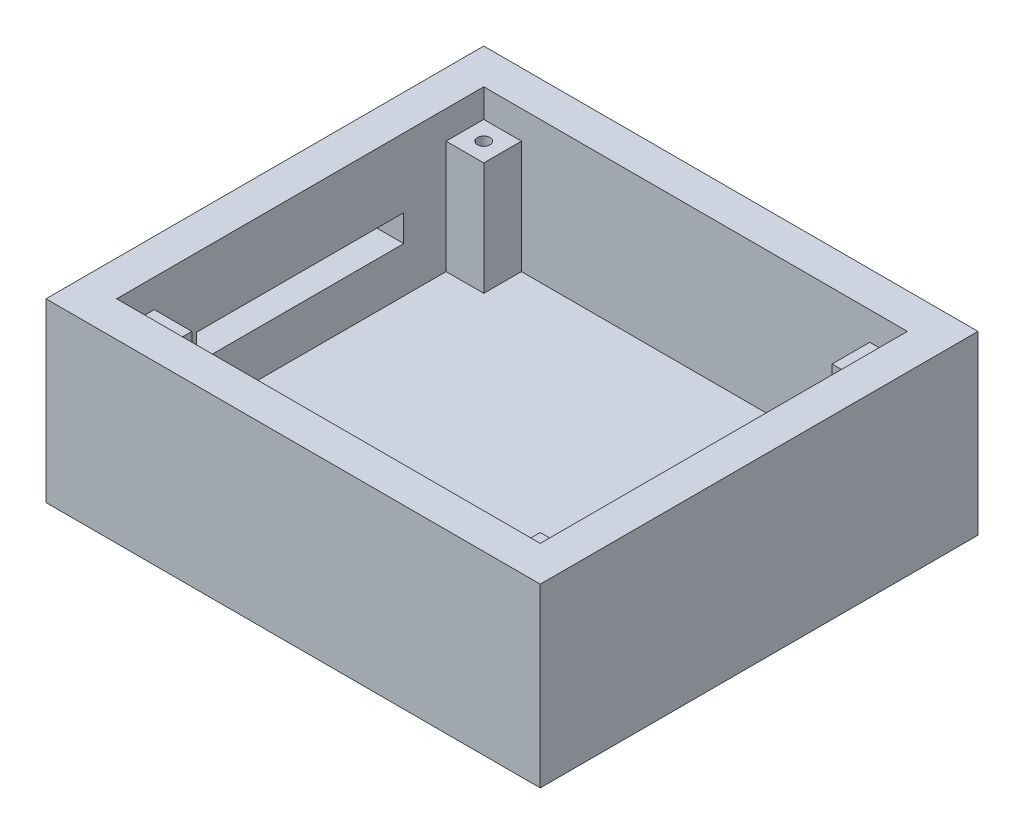
ISO-10303-21;
HEADER;
FILE_DESCRIPTION(('STEP AP214'),'2;1');
FILE_NAME('part.step','',(''),(''),'','','');
FILE_SCHEMA(('AUTOMOTIVE_DESIGN { 1 0 10303 214 1 1 1 1 }'));
ENDSEC;
DATA;
#1=APPLICATION_CONTEXT('core data for automotive mechanical design processes');
#2=APPLICATION_PROTOCOL_DEFINITION('international standard','automotive_design',2000,#1);
#3=PRODUCT_CONTEXT('',#1,'mechanical');
#4=PRODUCT('Part','Part','',(#3));
#5=PRODUCT_RELATED_PRODUCT_CATEGORY('part','',(#4));
#6=PRODUCT_DEFINITION_FORMATION('','',#4);
#7=PRODUCT_DEFINITION_CONTEXT('part definition',#1,'design');
#8=PRODUCT_DEFINITION('design','',#6,#7);
#9=PRODUCT_DEFINITION_SHAPE('','',#8);
#10=(LENGTH_UNIT() NAMED_UNIT(*) SI_UNIT(.MILLI.,.METRE.));
#11=(NAMED_UNIT(*) PLANE_ANGLE_UNIT() SI_UNIT($,.RADIAN.));
#12=(NAMED_UNIT(*) SI_UNIT($,.STERADIAN.) SOLID_ANGLE_UNIT());
#13=UNCERTAINTY_MEASURE_WITH_UNIT(LENGTH_MEASURE(1.E-05),#10,'distance_accuracy_value','');
#14=(GEOMETRIC_REPRESENTATION_CONTEXT(3) GLOBAL_UNCERTAINTY_ASSIGNED_CONTEXT((#13)) GLOBAL_UNIT_ASSIGNED_CONTEXT((#10,
#11,#12)) REPRESENTATION_CONTEXT('',''));
#15=CARTESIAN_POINT('',(0.,0.,0.));
#16=DIRECTION('',(0.,0.,1.));
#17=DIRECTION('',(1.,0.,0.));
#18=AXIS2_PLACEMENT_3D('',#15,#16,#17);
#19=CARTESIAN_POINT('',(-57.15,47.625,0.));
#20=DIRECTION('',(1.,0.,0.));
#21=DIRECTION('',(0.,0.,-1.));
#22=AXIS2_PLACEMENT_3D('',#19,#20,#21);
#23=PLANE('',#22);
#24=DIRECTION('',(0.,-1.,0.));
#25=VECTOR('',#24,1.);
#26=CARTESIAN_POINT('',(-57.15,47.625,27.94));
#27=LINE('',#26,#25);
#28=CARTESIAN_POINT('',(-57.15,29.0195,27.94));
#29=VERTEX_POINT('',#28);
#30=CARTESIAN_POINT('',(-57.15,21.7805,27.94));
#31=VERTEX_POINT('',#30);
#32=EDGE_CURVE('E230',#29,#31,#27,.T.);
#33=ORIENTED_EDGE('',*,*,#32,.F.);
#34=DIRECTION('',(0.,0.,1.));
#35=VECTOR('',#34,1.);
#36=CARTESIAN_POINT('',(-57.15,29.0195,0.));
#37=LINE('',#36,#35);
#38=CARTESIAN_POINT('',(-57.15,29.0195,-27.94));
#39=VERTEX_POINT('',#38);
#40=EDGE_CURVE('E223',#39,#29,#37,.T.);
#41=ORIENTED_EDGE('',*,*,#40,.F.);
#42=DIRECTION('',(0.,1.,0.));
#43=VECTOR('',#42,1.);
#44=CARTESIAN_POINT('',(-57.15,47.625,-27.94));
#45=LINE('',#44,#43);
#46=CARTESIAN_POINT('',(-57.15,21.7805,-27.94));
#47=VERTEX_POINT('',#46);
#48=EDGE_CURVE('E203',#47,#39,#45,.T.);
#49=ORIENTED_EDGE('',*,*,#48,.F.);
#50=DIRECTION('',(0.,0.,-1.));
#51=VECTOR('',#50,1.);
#52=CARTESIAN_POINT('',(-57.15,21.7805,0.));
#53=LINE('',#52,#51);
#54=EDGE_CURVE('E228',#31,#47,#53,.T.);
#55=ORIENTED_EDGE('',*,*,#54,.F.);
#56=EDGE_LOOP('',(#33,#41,#49,#55));
#57=FACE_BOUND('',#56,.T.);
#58=DIRECTION('',(0.,-1.,0.));
#59=VECTOR('',#58,1.);
#60=CARTESIAN_POINT('',(-57.15,47.625,49.53));
#61=LINE('',#60,#59);
#62=CARTESIAN_POINT('',(-57.15,47.625,49.53));
#63=VERTEX_POINT('',#62);
#64=CARTESIAN_POINT('',(-57.15,40.005,49.53));
#65=VERTEX_POINT('',#64);
#66=EDGE_CURVE('E370',#63,#65,#61,.T.);
#67=ORIENTED_EDGE('',*,*,#66,.T.);
#68=DIRECTION('',(0.,0.,1.));
#69=VECTOR('',#68,1.);
#70=CARTESIAN_POINT('',(-57.15,40.005,49.53));
#71=LINE('',#70,#69);
#72=CARTESIAN_POINT('',(-57.15,40.005,39.37));
#73=VERTEX_POINT('',#72);
#74=EDGE_CURVE('E236',#73,#65,#71,.T.);
#75=ORIENTED_EDGE('',*,*,#74,.F.);
#76=DIRECTION('',(0.,-1.,0.));
#77=VECTOR('',#76,1.);
#78=CARTESIAN_POINT('',(-57.15,40.005,39.37));
#79=LINE('',#78,#77);
#80=CARTESIAN_POINT('',(-57.15,9.525,39.37));
#81=VERTEX_POINT('',#80);
#82=EDGE_CURVE('E246',#73,#81,#79,.T.);
#83=ORIENTED_EDGE('',*,*,#82,.T.);
#84=DIRECTION('',(0.,0.,1.));
#85=VECTOR('',#84,1.);
#86=CARTESIAN_POINT('',(-57.15,9.525,0.));
#87=LINE('',#86,#85);
#88=CARTESIAN_POINT('',(-57.15,9.525,-39.37));
#89=VERTEX_POINT('',#88);
#90=EDGE_CURVE('E396',#89,#81,#87,.T.);
#91=ORIENTED_EDGE('',*,*,#90,.F.);
#92=DIRECTION('',(0.,-1.,0.));
#93=VECTOR('',#92,1.);
#94=CARTESIAN_POINT('',(-57.15,40.005,-39.37));
#95=LINE('',#94,#93);
#96=CARTESIAN_POINT('',(-57.15,40.005,-39.37));
#97=VERTEX_POINT('',#96);
#98=EDGE_CURVE('E334',#97,#89,#95,.T.);
#99=ORIENTED_EDGE('',*,*,#98,.F.);
#100=DIRECTION('',(0.,0.,1.));
#101=VECTOR('',#100,1.);
#102=CARTESIAN_POINT('',(-57.15,40.005,-49.53));
#103=LINE('',#102,#101);
#104=CARTESIAN_POINT('',(-57.15,40.005,-49.53));
#105=VERTEX_POINT('',#104);
#106=EDGE_CURVE('E313',#105,#97,#103,.T.);
#107=ORIENTED_EDGE('',*,*,#106,.F.);
#108=DIRECTION('',(0.,-1.,0.));
#109=VECTOR('',#108,1.);
#110=CARTESIAN_POINT('',(-57.15,47.625,-49.53));
#111=LINE('',#110,#109);
#112=CARTESIAN_POINT('',(-57.15,47.625,-49.53));
#113=VERTEX_POINT('',#112);
#114=EDGE_CURVE('E380',#113,#105,#111,.T.);
#115=ORIENTED_EDGE('',*,*,#114,.F.);
#116=DIRECTION('',(0.,0.,1.));
#117=VECTOR('',#116,1.);
#118=CARTESIAN_POINT('',(-57.15,47.625,0.));
#119=LINE('',#118,#117);
#120=EDGE_CURVE('E349',#113,#63,#119,.T.);
#121=ORIENTED_EDGE('',*,*,#120,.T.);
#122=EDGE_LOOP('',(#67,#75,#83,#91,#99,#107,#115,#121));
#123=FACE_BOUND('',#122,.T.);
#124=ADVANCED_FACE('F36',(#57,#123),#23,.T.);
#125=CARTESIAN_POINT('',(0.,47.625,49.53));
#126=DIRECTION('',(0.,0.,-1.));
#127=DIRECTION('',(-1.,0.,0.));
#128=AXIS2_PLACEMENT_3D('',#125,#126,#127);
#129=PLANE('',#128);
#130=DIRECTION('',(0.,-1.,0.));
#131=VECTOR('',#130,1.);
#132=CARTESIAN_POINT('',(-46.99,40.005,49.53));
#133=LINE('',#132,#131);
#134=CARTESIAN_POINT('',(-46.99,40.005,49.53));
#135=VERTEX_POINT('',#134);
#136=CARTESIAN_POINT('',(-46.99,9.525,49.53));
#137=VERTEX_POINT('',#136);
#138=EDGE_CURVE('E254',#135,#137,#133,.T.);
#139=ORIENTED_EDGE('',*,*,#138,.F.);
#140=DIRECTION('',(1.,0.,0.));
#141=VECTOR('',#140,1.);
#142=CARTESIAN_POINT('',(-57.15,40.005,49.53));
#143=LINE('',#142,#141);
#144=EDGE_CURVE('E238',#65,#135,#143,.T.);
#145=ORIENTED_EDGE('',*,*,#144,.F.);
#146=ORIENTED_EDGE('',*,*,#66,.F.);
#147=DIRECTION('',(1.,0.,0.));
#148=VECTOR('',#147,1.);
#149=CARTESIAN_POINT('',(0.,47.625,49.53));
#150=LINE('',#149,#148);
#151=CARTESIAN_POINT('',(57.15,47.625,49.53));
#152=VERTEX_POINT('',#151);
#153=EDGE_CURVE('E357',#63,#152,#150,.T.);
#154=ORIENTED_EDGE('',*,*,#153,.T.);
#155=DIRECTION('',(0.,-1.,0.));
#156=VECTOR('',#155,1.);
#157=CARTESIAN_POINT('',(57.15,47.625,49.53));
#158=LINE('',#157,#156);
#159=CARTESIAN_POINT('',(57.15,40.005,49.53));
#160=VERTEX_POINT('',#159);
#161=EDGE_CURVE('E373',#152,#160,#158,.T.);
#162=ORIENTED_EDGE('',*,*,#161,.T.);
#163=DIRECTION('',(1.,0.,0.));
#164=VECTOR('',#163,1.);
#165=CARTESIAN_POINT('',(57.15,40.005,49.53));
#166=LINE('',#165,#164);
#167=CARTESIAN_POINT('',(46.99,40.005,49.53));
#168=VERTEX_POINT('',#167);
#169=EDGE_CURVE('E268',#168,#160,#166,.T.);
#170=ORIENTED_EDGE('',*,*,#169,.F.);
#171=DIRECTION('',(0.,-1.,0.));
#172=VECTOR('',#171,1.);
#173=CARTESIAN_POINT('',(46.99,40.005,49.53));
#174=LINE('',#173,#172);
#175=CARTESIAN_POINT('',(46.99,9.525,49.53));
#176=VERTEX_POINT('',#175);
#177=EDGE_CURVE('E270',#168,#176,#174,.T.);
#178=ORIENTED_EDGE('',*,*,#177,.T.);
#179=DIRECTION('',(1.,0.,0.));
#180=VECTOR('',#179,1.);
#181=CARTESIAN_POINT('',(0.,9.525,49.53));
#182=LINE('',#181,#180);
#183=EDGE_CURVE('E399',#137,#176,#182,.T.);
#184=ORIENTED_EDGE('',*,*,#183,.F.);
#185=EDGE_LOOP('',(#139,#145,#146,#154,#162,#170,#178,#184));
#186=FACE_BOUND('',#185,.T.);
#187=ADVANCED_FACE('F438',(#186),#129,.T.);
#188=CARTESIAN_POINT('',(0.,47.625,-49.53));
#189=DIRECTION('',(0.,0.,-1.));
#190=DIRECTION('',(-1.,0.,0.));
#191=AXIS2_PLACEMENT_3D('',#188,#189,#190);
#192=PLANE('',#191);
#193=DIRECTION('',(-1.,0.,0.));
#194=VECTOR('',#193,1.);
#195=CARTESIAN_POINT('',(57.15,40.005,-49.53));
#196=LINE('',#195,#194);
#197=CARTESIAN_POINT('',(57.15,40.005,-49.53));
#198=VERTEX_POINT('',#197);
#199=CARTESIAN_POINT('',(46.99,40.005,-49.53));
#200=VERTEX_POINT('',#199);
#201=EDGE_CURVE('E288',#198,#200,#196,.T.);
#202=ORIENTED_EDGE('',*,*,#201,.F.);
#203=DIRECTION('',(0.,-1.,0.));
#204=VECTOR('',#203,1.);
#205=CARTESIAN_POINT('',(57.15,47.625,-49.53));
#206=LINE('',#205,#204);
#207=CARTESIAN_POINT('',(57.15,47.625,-49.53));
#208=VERTEX_POINT('',#207);
#209=EDGE_CURVE('E377',#208,#198,#206,.T.);
#210=ORIENTED_EDGE('',*,*,#209,.F.);
#211=DIRECTION('',(1.,0.,0.));
#212=VECTOR('',#211,1.);
#213=CARTESIAN_POINT('',(0.,47.625,-49.53));
#214=LINE('',#213,#212);
#215=EDGE_CURVE('E352',#113,#208,#214,.T.);
#216=ORIENTED_EDGE('',*,*,#215,.F.);
#217=ORIENTED_EDGE('',*,*,#114,.T.);
#218=DIRECTION('',(-1.,0.,0.));
#219=VECTOR('',#218,1.);
#220=CARTESIAN_POINT('',(-57.15,40.005,-49.53));
#221=LINE('',#220,#219);
#222=CARTESIAN_POINT('',(-46.99,40.005,-49.53));
#223=VERTEX_POINT('',#222);
#224=EDGE_CURVE('E322',#223,#105,#221,.T.);
#225=ORIENTED_EDGE('',*,*,#224,.F.);
#226=DIRECTION('',(0.,-1.,0.));
#227=VECTOR('',#226,1.);
#228=CARTESIAN_POINT('',(-46.99,40.005,-49.53));
#229=LINE('',#228,#227);
#230=CARTESIAN_POINT('',(-46.99,9.525,-49.53));
#231=VERTEX_POINT('',#230);
#232=EDGE_CURVE('E325',#223,#231,#229,.T.);
#233=ORIENTED_EDGE('',*,*,#232,.T.);
#234=DIRECTION('',(1.,0.,0.));
#235=VECTOR('',#234,1.);
#236=CARTESIAN_POINT('',(0.,9.525,-49.53));
#237=LINE('',#236,#235);
#238=CARTESIAN_POINT('',(46.99,9.525,-49.53));
#239=VERTEX_POINT('',#238);
#240=EDGE_CURVE('E393',#231,#239,#237,.T.);
#241=ORIENTED_EDGE('',*,*,#240,.T.);
#242=DIRECTION('',(0.,-1.,0.));
#243=VECTOR('',#242,1.);
#244=CARTESIAN_POINT('',(46.99,40.005,-49.53));
#245=LINE('',#244,#243);
#246=EDGE_CURVE('E306',#200,#239,#245,.T.);
#247=ORIENTED_EDGE('',*,*,#246,.F.);
#248=EDGE_LOOP('',(#202,#210,#216,#217,#225,#233,#241,#247));
#249=FACE_BOUND('',#248,.T.);
#250=ADVANCED_FACE('F444',(#249),#192,.F.);
#251=CARTESIAN_POINT('',(57.15,47.625,0.));
#252=DIRECTION('',(1.,0.,0.));
#253=DIRECTION('',(0.,0.,-1.));
#254=AXIS2_PLACEMENT_3D('',#251,#252,#253);
#255=PLANE('',#254);
#256=DIRECTION('',(0.,-1.,0.));
#257=VECTOR('',#256,1.);
#258=CARTESIAN_POINT('',(57.15,40.005,39.37));
#259=LINE('',#258,#257);
#260=CARTESIAN_POINT('',(57.15,40.005,39.37));
#261=VERTEX_POINT('',#260);
#262=CARTESIAN_POINT('',(57.15,9.525,39.37));
#263=VERTEX_POINT('',#262);
#264=EDGE_CURVE('E279',#261,#263,#259,.T.);
#265=ORIENTED_EDGE('',*,*,#264,.F.);
#266=DIRECTION('',(0.,0.,-1.));
#267=VECTOR('',#266,1.);
#268=CARTESIAN_POINT('',(57.15,40.005,49.53));
#269=LINE('',#268,#267);
#270=EDGE_CURVE('E260',#160,#261,#269,.T.);
#271=ORIENTED_EDGE('',*,*,#270,.F.);
#272=ORIENTED_EDGE('',*,*,#161,.F.);
#273=DIRECTION('',(0.,0.,1.));
#274=VECTOR('',#273,1.);
#275=CARTESIAN_POINT('',(57.15,47.625,0.));
#276=LINE('',#275,#274);
#277=EDGE_CURVE('E355',#208,#152,#276,.T.);
#278=ORIENTED_EDGE('',*,*,#277,.F.);
#279=ORIENTED_EDGE('',*,*,#209,.T.);
#280=DIRECTION('',(0.,0.,-1.));
#281=VECTOR('',#280,1.);
#282=CARTESIAN_POINT('',(57.15,40.005,-49.53));
#283=LINE('',#282,#281);
#284=CARTESIAN_POINT('',(57.15,40.005,-39.37));
#285=VERTEX_POINT('',#284);
#286=EDGE_CURVE('E285',#285,#198,#283,.T.);
#287=ORIENTED_EDGE('',*,*,#286,.F.);
#288=DIRECTION('',(0.,-1.,0.));
#289=VECTOR('',#288,1.);
#290=CARTESIAN_POINT('',(57.15,40.005,-39.37));
#291=LINE('',#290,#289);
#292=CARTESIAN_POINT('',(57.15,9.525,-39.37));
#293=VERTEX_POINT('',#292);
#294=EDGE_CURVE('E297',#285,#293,#291,.T.);
#295=ORIENTED_EDGE('',*,*,#294,.T.);
#296=DIRECTION('',(0.,0.,1.));
#297=VECTOR('',#296,1.);
#298=CARTESIAN_POINT('',(57.15,9.525,0.));
#299=LINE('',#298,#297);
#300=EDGE_CURVE('E383',#293,#263,#299,.T.);
#301=ORIENTED_EDGE('',*,*,#300,.T.);
#302=EDGE_LOOP('',(#265,#271,#272,#278,#279,#287,#295,#301));
#303=FACE_BOUND('',#302,.T.);
#304=ADVANCED_FACE('F468',(#303),#255,.F.);
#305=CARTESIAN_POINT('',(0.,9.525,0.));
#306=DIRECTION('',(0.,1.,0.));
#307=DIRECTION('',(0.,0.,1.));
#308=AXIS2_PLACEMENT_3D('',#305,#306,#307);
#309=PLANE('',#308);
#310=DIRECTION('',(-1.,0.,0.));
#311=VECTOR('',#310,1.);
#312=CARTESIAN_POINT('',(-57.15,9.525,39.37));
#313=LINE('',#312,#311);
#314=CARTESIAN_POINT('',(-46.99,9.525,39.37));
#315=VERTEX_POINT('',#314);
#316=EDGE_CURVE('E239',#315,#81,#313,.T.);
#317=ORIENTED_EDGE('',*,*,#316,.F.);
#318=DIRECTION('',(0.,0.,-1.));
#319=VECTOR('',#318,1.);
#320=CARTESIAN_POINT('',(-46.99,9.525,49.53));
#321=LINE('',#320,#319);
#322=EDGE_CURVE('E235',#137,#315,#321,.T.);
#323=ORIENTED_EDGE('',*,*,#322,.F.);
#324=ORIENTED_EDGE('',*,*,#183,.T.);
#325=DIRECTION('',(0.,0.,1.));
#326=VECTOR('',#325,1.);
#327=CARTESIAN_POINT('',(46.99,9.525,49.53));
#328=LINE('',#327,#326);
#329=CARTESIAN_POINT('',(46.99,9.525,39.37));
#330=VERTEX_POINT('',#329);
#331=EDGE_CURVE('E264',#330,#176,#328,.T.);
#332=ORIENTED_EDGE('',*,*,#331,.F.);
#333=DIRECTION('',(-1.,0.,0.));
#334=VECTOR('',#333,1.);
#335=CARTESIAN_POINT('',(57.15,9.525,39.37));
#336=LINE('',#335,#334);
#337=EDGE_CURVE('E259',#263,#330,#336,.T.);
#338=ORIENTED_EDGE('',*,*,#337,.F.);
#339=ORIENTED_EDGE('',*,*,#300,.F.);
#340=DIRECTION('',(1.,0.,0.));
#341=VECTOR('',#340,1.);
#342=CARTESIAN_POINT('',(57.15,9.525,-39.37));
#343=LINE('',#342,#341);
#344=CARTESIAN_POINT('',(46.99,9.525,-39.37));
#345=VERTEX_POINT('',#344);
#346=EDGE_CURVE('E289',#345,#293,#343,.T.);
#347=ORIENTED_EDGE('',*,*,#346,.F.);
#348=DIRECTION('',(0.,0.,1.));
#349=VECTOR('',#348,1.);
#350=CARTESIAN_POINT('',(46.99,9.525,-49.53));
#351=LINE('',#350,#349);
#352=EDGE_CURVE('E284',#239,#345,#351,.T.);
#353=ORIENTED_EDGE('',*,*,#352,.F.);
#354=ORIENTED_EDGE('',*,*,#240,.F.);
#355=DIRECTION('',(0.,0.,-1.));
#356=VECTOR('',#355,1.);
#357=CARTESIAN_POINT('',(-46.99,9.525,-49.53));
#358=LINE('',#357,#356);
#359=CARTESIAN_POINT('',(-46.99,9.525,-39.37));
#360=VERTEX_POINT('',#359);
#361=EDGE_CURVE('E317',#360,#231,#358,.T.);
#362=ORIENTED_EDGE('',*,*,#361,.F.);
#363=DIRECTION('',(1.,0.,0.));
#364=VECTOR('',#363,1.);
#365=CARTESIAN_POINT('',(-57.15,9.525,-39.37));
#366=LINE('',#365,#364);
#367=EDGE_CURVE('E312',#89,#360,#366,.T.);
#368=ORIENTED_EDGE('',*,*,#367,.F.);
#369=ORIENTED_EDGE('',*,*,#90,.T.);
#370=EDGE_LOOP('',(#317,#323,#324,#332,#338,#339,#347,#353,#354,#362,#368,#369));
#371=FACE_BOUND('',#370,.T.);
#372=ADVANCED_FACE('F426',(#371),#309,.T.);
#373=CARTESIAN_POINT('',(0.,47.625,59.055));
#374=DIRECTION('',(0.,0.,-1.));
#375=DIRECTION('',(-1.,0.,0.));
#376=AXIS2_PLACEMENT_3D('',#373,#374,#375);
#377=PLANE('',#376);
#378=DIRECTION('',(1.,0.,0.));
#379=VECTOR('',#378,1.);
#380=CARTESIAN_POINT('',(0.,0.,59.055));
#381=LINE('',#380,#379);
#382=CARTESIAN_POINT('',(-66.675,0.,59.055));
#383=VERTEX_POINT('',#382);
#384=CARTESIAN_POINT('',(66.675,0.,59.055));
#385=VERTEX_POINT('',#384);
#386=EDGE_CURVE('E337',#383,#385,#381,.T.);
#387=ORIENTED_EDGE('',*,*,#386,.T.);
#388=DIRECTION('',(0.,-1.,0.));
#389=VECTOR('',#388,1.);
#390=CARTESIAN_POINT('',(66.675,47.625,59.055));
#391=LINE('',#390,#389);
#392=CARTESIAN_POINT('',(66.675,47.625,59.055));
#393=VERTEX_POINT('',#392);
#394=EDGE_CURVE('E374',#393,#385,#391,.T.);
#395=ORIENTED_EDGE('',*,*,#394,.F.);
#396=DIRECTION('',(1.,0.,0.));
#397=VECTOR('',#396,1.);
#398=CARTESIAN_POINT('',(0.,47.625,59.055));
#399=LINE('',#398,#397);
#400=CARTESIAN_POINT('',(-66.675,47.625,59.055));
#401=VERTEX_POINT('',#400);
#402=EDGE_CURVE('E338',#401,#393,#399,.T.);
#403=ORIENTED_EDGE('',*,*,#402,.F.);
#404=DIRECTION('',(0.,-1.,0.));
#405=VECTOR('',#404,1.);
#406=CARTESIAN_POINT('',(-66.675,47.625,59.055));
#407=LINE('',#406,#405);
#408=EDGE_CURVE('E360',#401,#383,#407,.T.);
#409=ORIENTED_EDGE('',*,*,#408,.T.);
#410=EDGE_LOOP('',(#387,#395,#403,#409));
#411=FACE_BOUND('',#410,.T.);
#412=ADVANCED_FACE('F461',(#411),#377,.F.);
#413=CARTESIAN_POINT('',(66.675,47.625,0.));
#414=DIRECTION('',(1.,0.,0.));
#415=DIRECTION('',(0.,0.,-1.));
#416=AXIS2_PLACEMENT_3D('',#413,#414,#415);
#417=PLANE('',#416);
#418=DIRECTION('',(0.,0.,1.));
#419=VECTOR('',#418,1.);
#420=CARTESIAN_POINT('',(66.675,0.,0.));
#421=LINE('',#420,#419);
#422=CARTESIAN_POINT('',(66.675,0.,-59.055));
#423=VERTEX_POINT('',#422);
#424=EDGE_CURVE('E363',#423,#385,#421,.T.);
#425=ORIENTED_EDGE('',*,*,#424,.F.);
#426=DIRECTION('',(0.,-1.,0.));
#427=VECTOR('',#426,1.);
#428=CARTESIAN_POINT('',(66.675,47.625,-59.055));
#429=LINE('',#428,#427);
#430=CARTESIAN_POINT('',(66.675,47.625,-59.055));
#431=VERTEX_POINT('',#430);
#432=EDGE_CURVE('E388',#431,#423,#429,.T.);
#433=ORIENTED_EDGE('',*,*,#432,.F.);
#434=DIRECTION('',(0.,0.,1.));
#435=VECTOR('',#434,1.);
#436=CARTESIAN_POINT('',(66.675,47.625,0.));
#437=LINE('',#436,#435);
#438=EDGE_CURVE('E340',#431,#393,#437,.T.);
#439=ORIENTED_EDGE('',*,*,#438,.T.);
#440=ORIENTED_EDGE('',*,*,#394,.T.);
#441=EDGE_LOOP('',(#425,#433,#439,#440));
#442=FACE_BOUND('',#441,.T.);
#443=ADVANCED_FACE('F458',(#442),#417,.T.);
#444=CARTESIAN_POINT('',(0.,47.625,-59.055));
#445=DIRECTION('',(0.,0.,-1.));
#446=DIRECTION('',(-1.,0.,0.));
#447=AXIS2_PLACEMENT_3D('',#444,#445,#446);
#448=PLANE('',#447);
#449=DIRECTION('',(1.,0.,0.));
#450=VECTOR('',#449,1.);
#451=CARTESIAN_POINT('',(0.,0.,-59.055));
#452=LINE('',#451,#450);
#453=CARTESIAN_POINT('',(-66.675,0.,-59.055));
#454=VERTEX_POINT('',#453);
#455=EDGE_CURVE('E366',#454,#423,#452,.T.);
#456=ORIENTED_EDGE('',*,*,#455,.F.);
#457=DIRECTION('',(0.,-1.,0.));
#458=VECTOR('',#457,1.);
#459=CARTESIAN_POINT('',(-66.675,47.625,-59.055));
#460=LINE('',#459,#458);
#461=CARTESIAN_POINT('',(-66.675,47.625,-59.055));
#462=VERTEX_POINT('',#461);
#463=EDGE_CURVE('E386',#462,#454,#460,.T.);
#464=ORIENTED_EDGE('',*,*,#463,.F.);
#465=DIRECTION('',(1.,0.,0.));
#466=VECTOR('',#465,1.);
#467=CARTESIAN_POINT('',(0.,47.625,-59.055));
#468=LINE('',#467,#466);
#469=EDGE_CURVE('E344',#462,#431,#468,.T.);
#470=ORIENTED_EDGE('',*,*,#469,.T.);
#471=ORIENTED_EDGE('',*,*,#432,.T.);
#472=EDGE_LOOP('',(#456,#464,#470,#471));
#473=FACE_BOUND('',#472,.T.);
#474=ADVANCED_FACE('F455',(#473),#448,.T.);
#475=CARTESIAN_POINT('',(-66.675,47.625,0.));
#476=DIRECTION('',(1.,0.,0.));
#477=DIRECTION('',(0.,0.,-1.));
#478=AXIS2_PLACEMENT_3D('',#475,#476,#477);
#479=PLANE('',#478);
#480=DIRECTION('',(0.,0.,-1.));
#481=VECTOR('',#480,1.);
#482=CARTESIAN_POINT('',(-66.675,29.0195,-27.94));
#483=LINE('',#482,#481);
#484=CARTESIAN_POINT('',(-66.675,29.0195,27.94));
#485=VERTEX_POINT('',#484);
#486=CARTESIAN_POINT('',(-66.675,29.0195,-27.94));
#487=VERTEX_POINT('',#486);
#488=EDGE_CURVE('E209',#485,#487,#483,.T.);
#489=ORIENTED_EDGE('',*,*,#488,.F.);
#490=DIRECTION('',(0.,1.,0.));
#491=VECTOR('',#490,1.);
#492=CARTESIAN_POINT('',(-66.675,29.0195,27.94));
#493=LINE('',#492,#491);
#494=CARTESIAN_POINT('',(-66.675,21.7805,27.94));
#495=VERTEX_POINT('',#494);
#496=EDGE_CURVE('E59',#495,#485,#493,.T.);
#497=ORIENTED_EDGE('',*,*,#496,.F.);
#498=DIRECTION('',(0.,0.,1.));
#499=VECTOR('',#498,1.);
#500=CARTESIAN_POINT('',(-66.675,21.7805,-27.94));
#501=LINE('',#500,#499);
#502=CARTESIAN_POINT('',(-66.675,21.7805,-27.94));
#503=VERTEX_POINT('',#502);
#504=EDGE_CURVE('E216',#503,#495,#501,.T.);
#505=ORIENTED_EDGE('',*,*,#504,.F.);
#506=DIRECTION('',(0.,-1.,0.));
#507=VECTOR('',#506,1.);
#508=CARTESIAN_POINT('',(-66.675,29.0195,-27.94));
#509=LINE('',#508,#507);
#510=EDGE_CURVE('E200',#487,#503,#509,.T.);
#511=ORIENTED_EDGE('',*,*,#510,.F.);
#512=EDGE_LOOP('',(#489,#497,#505,#511));
#513=FACE_BOUND('',#512,.T.);
#514=DIRECTION('',(0.,0.,1.));
#515=VECTOR('',#514,1.);
#516=CARTESIAN_POINT('',(-66.675,0.,0.));
#517=LINE('',#516,#515);
#518=EDGE_CURVE('E341',#454,#383,#517,.T.);
#519=ORIENTED_EDGE('',*,*,#518,.T.);
#520=ORIENTED_EDGE('',*,*,#408,.F.);
#521=DIRECTION('',(0.,0.,1.));
#522=VECTOR('',#521,1.);
#523=CARTESIAN_POINT('',(-66.675,47.625,0.));
#524=LINE('',#523,#522);
#525=EDGE_CURVE('E347',#462,#401,#524,.T.);
#526=ORIENTED_EDGE('',*,*,#525,.F.);
#527=ORIENTED_EDGE('',*,*,#463,.T.);
#528=EDGE_LOOP('',(#519,#520,#526,#527));
#529=FACE_BOUND('',#528,.T.);
#530=ADVANCED_FACE('F213',(#513,#529),#479,.F.);
#531=CARTESIAN_POINT('',(0.,47.625,0.));
#532=DIRECTION('',(0.,1.,0.));
#533=DIRECTION('',(0.,0.,1.));
#534=AXIS2_PLACEMENT_3D('',#531,#532,#533);
#535=PLANE('',#534);
#536=ORIENTED_EDGE('',*,*,#402,.T.);
#537=ORIENTED_EDGE('',*,*,#438,.F.);
#538=ORIENTED_EDGE('',*,*,#469,.F.);
#539=ORIENTED_EDGE('',*,*,#525,.T.);
#540=EDGE_LOOP('',(#536,#537,#538,#539));
#541=FACE_BOUND('',#540,.T.);
#542=ORIENTED_EDGE('',*,*,#120,.F.);
#543=ORIENTED_EDGE('',*,*,#215,.T.);
#544=ORIENTED_EDGE('',*,*,#277,.T.);
#545=ORIENTED_EDGE('',*,*,#153,.F.);
#546=EDGE_LOOP('',(#542,#543,#544,#545));
#547=FACE_BOUND('',#546,.T.);
#548=ADVANCED_FACE('F454',(#541,#547),#535,.T.);
#549=CARTESIAN_POINT('',(0.,0.,0.));
#550=DIRECTION('',(0.,1.,0.));
#551=DIRECTION('',(0.,0.,1.));
#552=AXIS2_PLACEMENT_3D('',#549,#550,#551);
#553=PLANE('',#552);
#554=ORIENTED_EDGE('',*,*,#386,.F.);
#555=ORIENTED_EDGE('',*,*,#518,.F.);
#556=ORIENTED_EDGE('',*,*,#455,.T.);
#557=ORIENTED_EDGE('',*,*,#424,.T.);
#558=EDGE_LOOP('',(#554,#555,#556,#557));
#559=FACE_BOUND('',#558,.T.);
#560=ADVANCED_FACE('F38',(#559),#553,.F.);
#561=CARTESIAN_POINT('',(0.,40.005,0.));
#562=DIRECTION('',(0.,1.,0.));
#563=DIRECTION('',(0.,0.,1.));
#564=AXIS2_PLACEMENT_3D('',#561,#562,#563);
#565=PLANE('',#564);
#566=ORIENTED_EDGE('',*,*,#106,.T.);
#567=DIRECTION('',(1.,0.,0.));
#568=VECTOR('',#567,1.);
#569=CARTESIAN_POINT('',(-57.15,40.005,-39.37));
#570=LINE('',#569,#568);
#571=CARTESIAN_POINT('',(-46.99,40.005,-39.37));
#572=VERTEX_POINT('',#571);
#573=EDGE_CURVE('E316',#97,#572,#570,.T.);
#574=ORIENTED_EDGE('',*,*,#573,.T.);
#575=DIRECTION('',(0.,0.,-1.));
#576=VECTOR('',#575,1.);
#577=CARTESIAN_POINT('',(-46.99,40.005,-49.53));
#578=LINE('',#577,#576);
#579=EDGE_CURVE('E319',#572,#223,#578,.T.);
#580=ORIENTED_EDGE('',*,*,#579,.T.);
#581=ORIENTED_EDGE('',*,*,#224,.T.);
#582=EDGE_LOOP('',(#566,#574,#580,#581));
#583=FACE_BOUND('',#582,.T.);
#584=CARTESIAN_POINT('',(-52.07,40.005,-44.45));
#585=DIRECTION('',(0.,1.,0.));
#586=DIRECTION('',(0.,0.,1.));
#587=AXIS2_PLACEMENT_3D('',#584,#585,#586);
#588=CIRCLE('',#587,1.70180000000001);
#589=CARTESIAN_POINT('',(-52.07,40.005,-42.7482));
#590=VERTEX_POINT('',#589);
#591=EDGE_CURVE('E309',#590,#590,#588,.T.);
#592=ORIENTED_EDGE('',*,*,#591,.F.);
#593=EDGE_LOOP('',(#592));
#594=FACE_BOUND('',#593,.T.);
#595=ADVANCED_FACE('F537',(#583,#594),#565,.T.);
#596=CARTESIAN_POINT('',(-57.15,40.005,-39.37));
#597=DIRECTION('',(0.,0.,-1.));
#598=DIRECTION('',(-1.,0.,0.));
#599=AXIS2_PLACEMENT_3D('',#596,#597,#598);
#600=PLANE('',#599);
#601=ORIENTED_EDGE('',*,*,#367,.T.);
#602=DIRECTION('',(0.,-1.,0.));
#603=VECTOR('',#602,1.);
#604=CARTESIAN_POINT('',(-46.99,40.005,-39.37));
#605=LINE('',#604,#603);
#606=EDGE_CURVE('E331',#572,#360,#605,.T.);
#607=ORIENTED_EDGE('',*,*,#606,.F.);
#608=ORIENTED_EDGE('',*,*,#573,.F.);
#609=ORIENTED_EDGE('',*,*,#98,.T.);
#610=EDGE_LOOP('',(#601,#607,#608,#609));
#611=FACE_BOUND('',#610,.T.);
#612=ADVANCED_FACE('F530',(#611),#600,.F.);
#613=CARTESIAN_POINT('',(-46.99,40.005,-49.53));
#614=DIRECTION('',(-1.,0.,0.));
#615=DIRECTION('',(0.,0.,1.));
#616=AXIS2_PLACEMENT_3D('',#613,#614,#615);
#617=PLANE('',#616);
#618=ORIENTED_EDGE('',*,*,#361,.T.);
#619=ORIENTED_EDGE('',*,*,#232,.F.);
#620=ORIENTED_EDGE('',*,*,#579,.F.);
#621=ORIENTED_EDGE('',*,*,#606,.T.);
#622=EDGE_LOOP('',(#618,#619,#620,#621));
#623=FACE_BOUND('',#622,.T.);
#624=ADVANCED_FACE('F534',(#623),#617,.F.);
#625=CARTESIAN_POINT('',(-52.07,40.005,-44.45));
#626=DIRECTION('',(0.,-1.,0.));
#627=DIRECTION('',(0.,0.,-1.));
#628=AXIS2_PLACEMENT_3D('',#625,#626,#627);
#629=CYLINDRICAL_SURFACE('',#628,1.70180000000001);
#630=ORIENTED_EDGE('',*,*,#591,.T.);
#631=EDGE_LOOP('',(#630));
#632=FACE_BOUND('',#631,.T.);
#633=CARTESIAN_POINT('',(-52.07,9.525,-44.45));
#634=DIRECTION('',(0.,1.,0.));
#635=DIRECTION('',(0.,0.,1.));
#636=AXIS2_PLACEMENT_3D('',#633,#634,#635);
#637=CIRCLE('',#636,1.70180000000001);
#638=CARTESIAN_POINT('',(-52.07,9.525,-42.7482));
#639=VERTEX_POINT('',#638);
#640=EDGE_CURVE('E401',#639,#639,#637,.F.);
#641=ORIENTED_EDGE('',*,*,#640,.T.);
#642=EDGE_LOOP('',(#641));
#643=FACE_BOUND('',#642,.T.);
#644=ADVANCED_FACE('F550',(#632,#643),#629,.F.);
#645=ORIENTED_EDGE('',*,*,#640,.F.);
#646=EDGE_LOOP('',(#645));
#647=FACE_BOUND('',#646,.T.);
#648=ADVANCED_FACE('F432',(#647),#309,.T.);
#649=CARTESIAN_POINT('',(0.,40.005,0.));
#650=DIRECTION('',(0.,-1.,0.));
#651=DIRECTION('',(0.,0.,-1.));
#652=AXIS2_PLACEMENT_3D('',#649,#650,#651);
#653=PLANE('',#652);
#654=ORIENTED_EDGE('',*,*,#286,.T.);
#655=ORIENTED_EDGE('',*,*,#201,.T.);
#656=DIRECTION('',(0.,0.,1.));
#657=VECTOR('',#656,1.);
#658=CARTESIAN_POINT('',(46.99,40.005,-49.53));
#659=LINE('',#658,#657);
#660=CARTESIAN_POINT('',(46.99,40.005,-39.37));
#661=VERTEX_POINT('',#660);
#662=EDGE_CURVE('E292',#200,#661,#659,.T.);
#663=ORIENTED_EDGE('',*,*,#662,.T.);
#664=DIRECTION('',(1.,0.,0.));
#665=VECTOR('',#664,1.);
#666=CARTESIAN_POINT('',(57.15,40.005,-39.37));
#667=LINE('',#666,#665);
#668=EDGE_CURVE('E294',#661,#285,#667,.T.);
#669=ORIENTED_EDGE('',*,*,#668,.T.);
#670=EDGE_LOOP('',(#654,#655,#663,#669));
#671=FACE_BOUND('',#670,.T.);
#672=CARTESIAN_POINT('',(52.07,40.005,-44.45));
#673=DIRECTION('',(0.,1.,0.));
#674=DIRECTION('',(0.,0.,1.));
#675=AXIS2_PLACEMENT_3D('',#672,#673,#674);
#676=CIRCLE('',#675,1.70180000000001);
#677=CARTESIAN_POINT('',(52.07,40.005,-42.7482));
#678=VERTEX_POINT('',#677);
#679=EDGE_CURVE('E281',#678,#678,#676,.T.);
#680=ORIENTED_EDGE('',*,*,#679,.F.);
#681=EDGE_LOOP('',(#680));
#682=FACE_BOUND('',#681,.T.);
#683=ADVANCED_FACE('F495',(#671,#682),#653,.F.);
#684=CARTESIAN_POINT('',(46.99,40.005,-49.53));
#685=DIRECTION('',(1.,0.,0.));
#686=DIRECTION('',(0.,0.,-1.));
#687=AXIS2_PLACEMENT_3D('',#684,#685,#686);
#688=PLANE('',#687);
#689=ORIENTED_EDGE('',*,*,#352,.T.);
#690=DIRECTION('',(0.,-1.,0.));
#691=VECTOR('',#690,1.);
#692=CARTESIAN_POINT('',(46.99,40.005,-39.37));
#693=LINE('',#692,#691);
#694=EDGE_CURVE('E303',#661,#345,#693,.T.);
#695=ORIENTED_EDGE('',*,*,#694,.F.);
#696=ORIENTED_EDGE('',*,*,#662,.F.);
#697=ORIENTED_EDGE('',*,*,#246,.T.);
#698=EDGE_LOOP('',(#689,#695,#696,#697));
#699=FACE_BOUND('',#698,.T.);
#700=ADVANCED_FACE('F540',(#699),#688,.F.);
#701=CARTESIAN_POINT('',(57.15,40.005,-39.37));
#702=DIRECTION('',(0.,0.,-1.));
#703=DIRECTION('',(-1.,0.,0.));
#704=AXIS2_PLACEMENT_3D('',#701,#702,#703);
#705=PLANE('',#704);
#706=ORIENTED_EDGE('',*,*,#346,.T.);
#707=ORIENTED_EDGE('',*,*,#294,.F.);
#708=ORIENTED_EDGE('',*,*,#668,.F.);
#709=ORIENTED_EDGE('',*,*,#694,.T.);
#710=EDGE_LOOP('',(#706,#707,#708,#709));
#711=FACE_BOUND('',#710,.T.);
#712=ADVANCED_FACE('F502',(#711),#705,.F.);
#713=CARTESIAN_POINT('',(52.07,40.005,-44.45));
#714=DIRECTION('',(0.,-1.,0.));
#715=DIRECTION('',(0.,0.,-1.));
#716=AXIS2_PLACEMENT_3D('',#713,#714,#715);
#717=CYLINDRICAL_SURFACE('',#716,1.70180000000001);
#718=ORIENTED_EDGE('',*,*,#679,.T.);
#719=EDGE_LOOP('',(#718));
#720=FACE_BOUND('',#719,.T.);
#721=CARTESIAN_POINT('',(52.07,9.525,-44.45));
#722=DIRECTION('',(0.,1.,0.));
#723=DIRECTION('',(0.,0.,1.));
#724=AXIS2_PLACEMENT_3D('',#721,#722,#723);
#725=CIRCLE('',#724,1.70180000000001);
#726=CARTESIAN_POINT('',(52.07,9.525,-42.7482));
#727=VERTEX_POINT('',#726);
#728=EDGE_CURVE('E404',#727,#727,#725,.F.);
#729=ORIENTED_EDGE('',*,*,#728,.T.);
#730=EDGE_LOOP('',(#729));
#731=FACE_BOUND('',#730,.T.);
#732=ADVANCED_FACE('F430',(#720,#731),#717,.F.);
#733=ORIENTED_EDGE('',*,*,#728,.F.);
#734=EDGE_LOOP('',(#733));
#735=FACE_BOUND('',#734,.T.);
#736=ADVANCED_FACE('F414',(#735),#309,.T.);
#737=CARTESIAN_POINT('',(0.,40.005,0.));
#738=DIRECTION('',(0.,1.,0.));
#739=DIRECTION('',(0.,0.,1.));
#740=AXIS2_PLACEMENT_3D('',#737,#738,#739);
#741=PLANE('',#740);
#742=ORIENTED_EDGE('',*,*,#270,.T.);
#743=DIRECTION('',(-1.,0.,0.));
#744=VECTOR('',#743,1.);
#745=CARTESIAN_POINT('',(57.15,40.005,39.37));
#746=LINE('',#745,#744);
#747=CARTESIAN_POINT('',(46.99,40.005,39.37));
#748=VERTEX_POINT('',#747);
#749=EDGE_CURVE('E263',#261,#748,#746,.T.);
#750=ORIENTED_EDGE('',*,*,#749,.T.);
#751=DIRECTION('',(0.,0.,1.));
#752=VECTOR('',#751,1.);
#753=CARTESIAN_POINT('',(46.99,40.005,49.53));
#754=LINE('',#753,#752);
#755=EDGE_CURVE('E266',#748,#168,#754,.T.);
#756=ORIENTED_EDGE('',*,*,#755,.T.);
#757=ORIENTED_EDGE('',*,*,#169,.T.);
#758=EDGE_LOOP('',(#742,#750,#756,#757));
#759=FACE_BOUND('',#758,.T.);
#760=CARTESIAN_POINT('',(52.07,40.005,44.45));
#761=DIRECTION('',(0.,1.,0.));
#762=DIRECTION('',(0.,0.,1.));
#763=AXIS2_PLACEMENT_3D('',#760,#761,#762);
#764=CIRCLE('',#763,1.70180000000001);
#765=CARTESIAN_POINT('',(52.07,40.005,46.1518));
#766=VERTEX_POINT('',#765);
#767=EDGE_CURVE('E256',#766,#766,#764,.T.);
#768=ORIENTED_EDGE('',*,*,#767,.F.);
#769=EDGE_LOOP('',(#768));
#770=FACE_BOUND('',#769,.T.);
#771=ADVANCED_FACE('F429',(#759,#770),#741,.T.);
#772=CARTESIAN_POINT('',(57.15,40.005,39.37));
#773=DIRECTION('',(0.,0.,1.));
#774=DIRECTION('',(1.,0.,0.));
#775=AXIS2_PLACEMENT_3D('',#772,#773,#774);
#776=PLANE('',#775);
#777=ORIENTED_EDGE('',*,*,#337,.T.);
#778=DIRECTION('',(0.,-1.,0.));
#779=VECTOR('',#778,1.);
#780=CARTESIAN_POINT('',(46.99,40.005,39.37));
#781=LINE('',#780,#779);
#782=EDGE_CURVE('E276',#748,#330,#781,.T.);
#783=ORIENTED_EDGE('',*,*,#782,.F.);
#784=ORIENTED_EDGE('',*,*,#749,.F.);
#785=ORIENTED_EDGE('',*,*,#264,.T.);
#786=EDGE_LOOP('',(#777,#783,#784,#785));
#787=FACE_BOUND('',#786,.T.);
#788=ADVANCED_FACE('F509',(#787),#776,.F.);
#789=CARTESIAN_POINT('',(46.99,40.005,49.53));
#790=DIRECTION('',(1.,0.,0.));
#791=DIRECTION('',(0.,0.,-1.));
#792=AXIS2_PLACEMENT_3D('',#789,#790,#791);
#793=PLANE('',#792);
#794=ORIENTED_EDGE('',*,*,#331,.T.);
#795=ORIENTED_EDGE('',*,*,#177,.F.);
#796=ORIENTED_EDGE('',*,*,#755,.F.);
#797=ORIENTED_EDGE('',*,*,#782,.T.);
#798=EDGE_LOOP('',(#794,#795,#796,#797));
#799=FACE_BOUND('',#798,.T.);
#800=ADVANCED_FACE('F423',(#799),#793,.F.);
#801=CARTESIAN_POINT('',(52.07,40.005,44.45));
#802=DIRECTION('',(0.,-1.,0.));
#803=DIRECTION('',(0.,0.,-1.));
#804=AXIS2_PLACEMENT_3D('',#801,#802,#803);
#805=CYLINDRICAL_SURFACE('',#804,1.70180000000001);
#806=ORIENTED_EDGE('',*,*,#767,.T.);
#807=EDGE_LOOP('',(#806));
#808=FACE_BOUND('',#807,.T.);
#809=CARTESIAN_POINT('',(52.07,9.525,44.45));
#810=DIRECTION('',(0.,1.,0.));
#811=DIRECTION('',(0.,0.,1.));
#812=AXIS2_PLACEMENT_3D('',#809,#810,#811);
#813=CIRCLE('',#812,1.70180000000001);
#814=CARTESIAN_POINT('',(52.07,9.525,46.1518));
#815=VERTEX_POINT('',#814);
#816=EDGE_CURVE('E44',#815,#815,#813,.F.);
#817=ORIENTED_EDGE('',*,*,#816,.T.);
#818=EDGE_LOOP('',(#817));
#819=FACE_BOUND('',#818,.T.);
#820=ADVANCED_FACE('F409',(#808,#819),#805,.F.);
#821=ORIENTED_EDGE('',*,*,#816,.F.);
#822=EDGE_LOOP('',(#821));
#823=FACE_BOUND('',#822,.T.);
#824=ADVANCED_FACE('F411',(#823),#309,.T.);
#825=CARTESIAN_POINT('',(0.,40.005,0.));
#826=DIRECTION('',(0.,-1.,0.));
#827=DIRECTION('',(0.,0.,-1.));
#828=AXIS2_PLACEMENT_3D('',#825,#826,#827);
#829=PLANE('',#828);
#830=ORIENTED_EDGE('',*,*,#74,.T.);
#831=ORIENTED_EDGE('',*,*,#144,.T.);
#832=DIRECTION('',(0.,0.,-1.));
#833=VECTOR('',#832,1.);
#834=CARTESIAN_POINT('',(-46.99,40.005,49.53));
#835=LINE('',#834,#833);
#836=CARTESIAN_POINT('',(-46.99,40.005,39.37));
#837=VERTEX_POINT('',#836);
#838=EDGE_CURVE('E242',#135,#837,#835,.T.);
#839=ORIENTED_EDGE('',*,*,#838,.T.);
#840=DIRECTION('',(-1.,0.,0.));
#841=VECTOR('',#840,1.);
#842=CARTESIAN_POINT('',(-57.15,40.005,39.37));
#843=LINE('',#842,#841);
#844=EDGE_CURVE('E244',#837,#73,#843,.T.);
#845=ORIENTED_EDGE('',*,*,#844,.T.);
#846=EDGE_LOOP('',(#830,#831,#839,#845));
#847=FACE_BOUND('',#846,.T.);
#848=CARTESIAN_POINT('',(-52.07,40.005,44.45));
#849=DIRECTION('',(0.,1.,0.));
#850=DIRECTION('',(0.,0.,1.));
#851=AXIS2_PLACEMENT_3D('',#848,#849,#850);
#852=CIRCLE('',#851,1.70180000000001);
#853=CARTESIAN_POINT('',(-52.07,40.005,46.1518));
#854=VERTEX_POINT('',#853);
#855=EDGE_CURVE('E232',#854,#854,#852,.T.);
#856=ORIENTED_EDGE('',*,*,#855,.F.);
#857=EDGE_LOOP('',(#856));
#858=FACE_BOUND('',#857,.T.);
#859=ADVANCED_FACE('F413',(#847,#858),#829,.F.);
#860=CARTESIAN_POINT('',(-46.99,40.005,49.53));
#861=DIRECTION('',(-1.,0.,0.));
#862=DIRECTION('',(0.,0.,1.));
#863=AXIS2_PLACEMENT_3D('',#860,#861,#862);
#864=PLANE('',#863);
#865=ORIENTED_EDGE('',*,*,#322,.T.);
#866=DIRECTION('',(0.,-1.,0.));
#867=VECTOR('',#866,1.);
#868=CARTESIAN_POINT('',(-46.99,40.005,39.37));
#869=LINE('',#868,#867);
#870=EDGE_CURVE('E251',#837,#315,#869,.T.);
#871=ORIENTED_EDGE('',*,*,#870,.F.);
#872=ORIENTED_EDGE('',*,*,#838,.F.);
#873=ORIENTED_EDGE('',*,*,#138,.T.);
#874=EDGE_LOOP('',(#865,#871,#872,#873));
#875=FACE_BOUND('',#874,.T.);
#876=ADVANCED_FACE('F420',(#875),#864,.F.);
#877=CARTESIAN_POINT('',(-57.15,40.005,39.37));
#878=DIRECTION('',(0.,0.,1.));
#879=DIRECTION('',(1.,0.,0.));
#880=AXIS2_PLACEMENT_3D('',#877,#878,#879);
#881=PLANE('',#880);
#882=ORIENTED_EDGE('',*,*,#316,.T.);
#883=ORIENTED_EDGE('',*,*,#82,.F.);
#884=ORIENTED_EDGE('',*,*,#844,.F.);
#885=ORIENTED_EDGE('',*,*,#870,.T.);
#886=EDGE_LOOP('',(#882,#883,#884,#885));
#887=FACE_BOUND('',#886,.T.);
#888=ADVANCED_FACE('F739',(#887),#881,.F.);
#889=CARTESIAN_POINT('',(-52.07,40.005,44.45));
#890=DIRECTION('',(0.,-1.,0.));
#891=DIRECTION('',(0.,0.,-1.));
#892=AXIS2_PLACEMENT_3D('',#889,#890,#891);
#893=CYLINDRICAL_SURFACE('',#892,1.70180000000001);
#894=ORIENTED_EDGE('',*,*,#855,.T.);
#895=EDGE_LOOP('',(#894));
#896=FACE_BOUND('',#895,.T.);
#897=CARTESIAN_POINT('',(-52.07,9.525,44.45));
#898=DIRECTION('',(0.,1.,0.));
#899=DIRECTION('',(0.,0.,1.));
#900=AXIS2_PLACEMENT_3D('',#897,#898,#899);
#901=CIRCLE('',#900,1.70180000000001);
#902=CARTESIAN_POINT('',(-52.07,9.525,46.1518));
#903=VERTEX_POINT('',#902);
#904=EDGE_CURVE('E11',#903,#903,#901,.F.);
#905=ORIENTED_EDGE('',*,*,#904,.T.);
#906=EDGE_LOOP('',(#905));
#907=FACE_BOUND('',#906,.T.);
#908=ADVANCED_FACE('F435',(#896,#907),#893,.F.);
#909=ORIENTED_EDGE('',*,*,#904,.F.);
#910=EDGE_LOOP('',(#909));
#911=FACE_BOUND('',#910,.T.);
#912=ADVANCED_FACE('F415',(#911),#309,.T.);
#913=CARTESIAN_POINT('',(-36.195,29.0195,27.94));
#914=DIRECTION('',(0.,0.,1.));
#915=DIRECTION('',(1.,0.,0.));
#916=AXIS2_PLACEMENT_3D('',#913,#914,#915);
#917=PLANE('',#916);
#918=ORIENTED_EDGE('',*,*,#32,.T.);
#919=DIRECTION('',(-1.,0.,0.));
#920=VECTOR('',#919,1.);
#921=CARTESIAN_POINT('',(-36.195,21.7805,27.94));
#922=LINE('',#921,#920);
#923=EDGE_CURVE('E221',#31,#495,#922,.T.);
#924=ORIENTED_EDGE('',*,*,#923,.T.);
#925=ORIENTED_EDGE('',*,*,#496,.T.);
#926=DIRECTION('',(-1.,0.,0.));
#927=VECTOR('',#926,1.);
#928=CARTESIAN_POINT('',(-36.195,29.0195,27.94));
#929=LINE('',#928,#927);
#930=EDGE_CURVE('E206',#29,#485,#929,.T.);
#931=ORIENTED_EDGE('',*,*,#930,.F.);
#932=EDGE_LOOP('',(#918,#924,#925,#931));
#933=FACE_BOUND('',#932,.T.);
#934=ADVANCED_FACE('F434',(#933),#917,.F.);
#935=CARTESIAN_POINT('',(-36.195,21.7805,-27.94));
#936=DIRECTION('',(0.,-1.,0.));
#937=DIRECTION('',(0.,0.,-1.));
#938=AXIS2_PLACEMENT_3D('',#935,#936,#937);
#939=PLANE('',#938);
#940=ORIENTED_EDGE('',*,*,#54,.T.);
#941=DIRECTION('',(-1.,0.,0.));
#942=VECTOR('',#941,1.);
#943=CARTESIAN_POINT('',(-36.195,21.7805,-27.94));
#944=LINE('',#943,#942);
#945=EDGE_CURVE('E205',#47,#503,#944,.T.);
#946=ORIENTED_EDGE('',*,*,#945,.T.);
#947=ORIENTED_EDGE('',*,*,#504,.T.);
#948=ORIENTED_EDGE('',*,*,#923,.F.);
#949=EDGE_LOOP('',(#940,#946,#947,#948));
#950=FACE_BOUND('',#949,.T.);
#951=ADVANCED_FACE('F781',(#950),#939,.F.);
#952=CARTESIAN_POINT('',(-36.195,29.0195,-27.94));
#953=DIRECTION('',(0.,0.,-1.));
#954=DIRECTION('',(-1.,0.,0.));
#955=AXIS2_PLACEMENT_3D('',#952,#953,#954);
#956=PLANE('',#955);
#957=ORIENTED_EDGE('',*,*,#48,.T.);
#958=DIRECTION('',(-1.,0.,0.));
#959=VECTOR('',#958,1.);
#960=CARTESIAN_POINT('',(-36.195,29.0195,-27.94));
#961=LINE('',#960,#959);
#962=EDGE_CURVE('E51',#39,#487,#961,.T.);
#963=ORIENTED_EDGE('',*,*,#962,.T.);
#964=ORIENTED_EDGE('',*,*,#510,.T.);
#965=ORIENTED_EDGE('',*,*,#945,.F.);
#966=EDGE_LOOP('',(#957,#963,#964,#965));
#967=FACE_BOUND('',#966,.T.);
#968=ADVANCED_FACE('F197',(#967),#956,.F.);
#969=CARTESIAN_POINT('',(-36.195,29.0195,-27.94));
#970=DIRECTION('',(0.,1.,0.));
#971=DIRECTION('',(0.,0.,1.));
#972=AXIS2_PLACEMENT_3D('',#969,#970,#971);
#973=PLANE('',#972);
#974=ORIENTED_EDGE('',*,*,#40,.T.);
#975=ORIENTED_EDGE('',*,*,#930,.T.);
#976=ORIENTED_EDGE('',*,*,#488,.T.);
#977=ORIENTED_EDGE('',*,*,#962,.F.);
#978=EDGE_LOOP('',(#974,#975,#976,#977));
#979=FACE_BOUND('',#978,.T.);
#980=ADVANCED_FACE('F210',(#979),#973,.F.);
#981=CLOSED_SHELL('',(#124,#187,#250,#304,#372,#412,#443,#474,#530,#548,#560,#595,#612,#624,
#644,#648,#683,#700,#712,#732,#736,#771,#788,#800,#820,#824,#859,#876,#888,#908,#912,#934,#951,
#968,#980));
#982=MANIFOLD_SOLID_BREP('B2',#981);
#983=ADVANCED_BREP_SHAPE_REPRESENTATION('',(#18,#982),#14);
#984=SHAPE_DEFINITION_REPRESENTATION(#9,#983);
ENDSEC;
END-ISO-10303-21;
